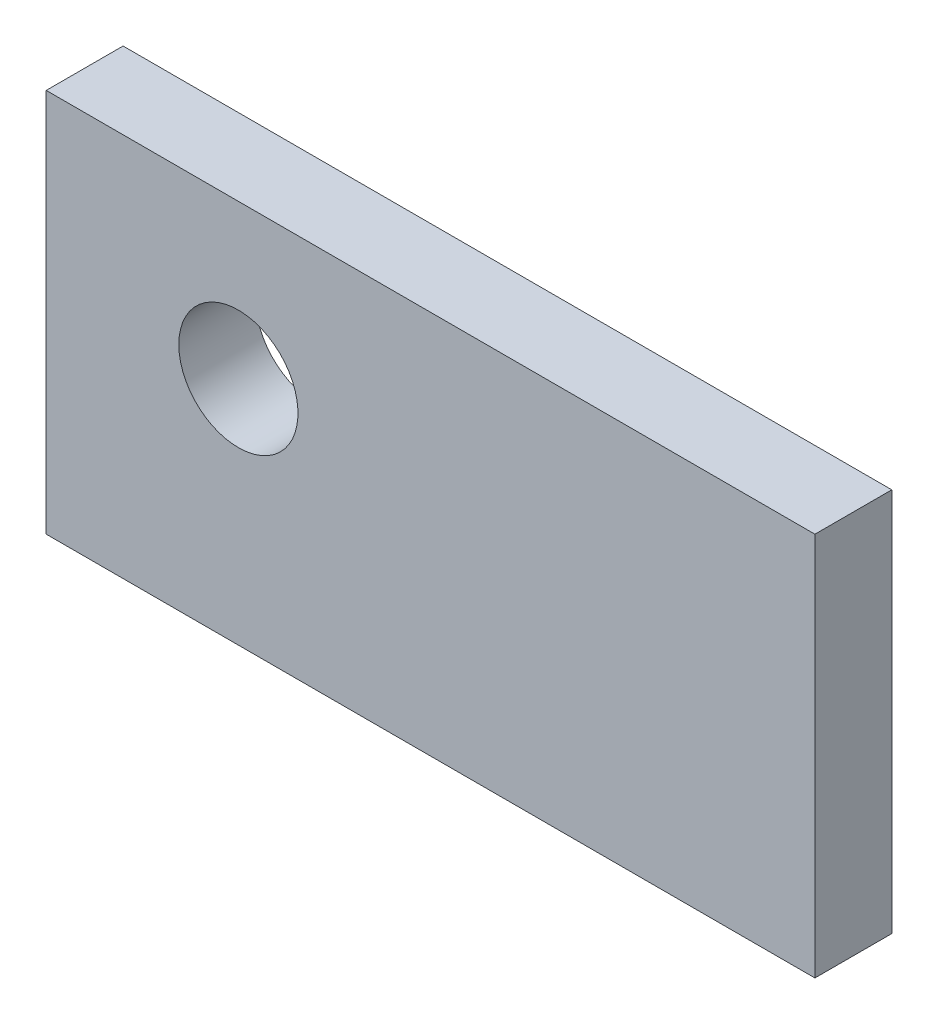
ISO-10303-21;
HEADER;
FILE_DESCRIPTION(('STEP AP214'),'2;1');
FILE_NAME('part.step','',(''),(''),'','','');
FILE_SCHEMA(('AUTOMOTIVE_DESIGN { 1 0 10303 214 1 1 1 1 }'));
ENDSEC;
DATA;
#1=APPLICATION_CONTEXT('core data for automotive mechanical design processes');
#2=APPLICATION_PROTOCOL_DEFINITION('international standard','automotive_design',2000,#1);
#3=PRODUCT_CONTEXT('',#1,'mechanical');
#4=PRODUCT('Part','Part','',(#3));
#5=PRODUCT_RELATED_PRODUCT_CATEGORY('part','',(#4));
#6=PRODUCT_DEFINITION_FORMATION('','',#4);
#7=PRODUCT_DEFINITION_CONTEXT('part definition',#1,'design');
#8=PRODUCT_DEFINITION('design','',#6,#7);
#9=PRODUCT_DEFINITION_SHAPE('','',#8);
#10=(LENGTH_UNIT() NAMED_UNIT(*) SI_UNIT(.MILLI.,.METRE.));
#11=(NAMED_UNIT(*) PLANE_ANGLE_UNIT() SI_UNIT($,.RADIAN.));
#12=(NAMED_UNIT(*) SI_UNIT($,.STERADIAN.) SOLID_ANGLE_UNIT());
#13=UNCERTAINTY_MEASURE_WITH_UNIT(LENGTH_MEASURE(1.E-05),#10,'distance_accuracy_value','');
#14=(GEOMETRIC_REPRESENTATION_CONTEXT(3) GLOBAL_UNCERTAINTY_ASSIGNED_CONTEXT((#13)) GLOBAL_UNIT_ASSIGNED_CONTEXT((#10,
#11,#12)) REPRESENTATION_CONTEXT('',''));
#15=CARTESIAN_POINT('',(0.,0.,0.));
#16=DIRECTION('',(0.,0.,1.));
#17=DIRECTION('',(1.,0.,0.));
#18=AXIS2_PLACEMENT_3D('',#15,#16,#17);
#19=CARTESIAN_POINT('',(40.,0.,0.));
#20=DIRECTION('',(0.,0.,-1.));
#21=DIRECTION('',(-1.,0.,0.));
#22=AXIS2_PLACEMENT_3D('',#19,#20,#21);
#23=PLANE('',#22);
#24=CARTESIAN_POINT('',(10.,12.,0.));
#25=DIRECTION('',(0.,0.,-1.));
#26=DIRECTION('',(-1.,0.,0.));
#27=AXIS2_PLACEMENT_3D('',#24,#25,#26);
#28=CIRCLE('',#27,3.1);
#29=CARTESIAN_POINT('',(6.9,12.,0.));
#30=VERTEX_POINT('',#29);
#31=EDGE_CURVE('E111',#30,#30,#28,.T.);
#32=ORIENTED_EDGE('',*,*,#31,.T.);
#33=EDGE_LOOP('',(#32));
#34=FACE_BOUND('',#33,.T.);
#35=DIRECTION('',(0.,-1.,0.));
#36=VECTOR('',#35,1.);
#37=CARTESIAN_POINT('',(0.,0.,0.));
#38=LINE('',#37,#36);
#39=CARTESIAN_POINT('',(0.,20.,0.));
#40=VERTEX_POINT('',#39);
#41=CARTESIAN_POINT('',(0.,0.,0.));
#42=VERTEX_POINT('',#41);
#43=EDGE_CURVE('E107',#40,#42,#38,.T.);
#44=ORIENTED_EDGE('',*,*,#43,.T.);
#45=DIRECTION('',(-1.,0.,0.));
#46=VECTOR('',#45,1.);
#47=CARTESIAN_POINT('',(40.,0.,0.));
#48=LINE('',#47,#46);
#49=CARTESIAN_POINT('',(40.,0.,0.));
#50=VERTEX_POINT('',#49);
#51=EDGE_CURVE('E11',#50,#42,#48,.T.);
#52=ORIENTED_EDGE('',*,*,#51,.F.);
#53=DIRECTION('',(0.,-1.,0.));
#54=VECTOR('',#53,1.);
#55=CARTESIAN_POINT('',(40.,0.,0.));
#56=LINE('',#55,#54);
#57=CARTESIAN_POINT('',(40.,20.,0.));
#58=VERTEX_POINT('',#57);
#59=EDGE_CURVE('E91',#58,#50,#56,.T.);
#60=ORIENTED_EDGE('',*,*,#59,.F.);
#61=DIRECTION('',(-1.,0.,0.));
#62=VECTOR('',#61,1.);
#63=CARTESIAN_POINT('',(40.,20.,0.));
#64=LINE('',#63,#62);
#65=EDGE_CURVE('E103',#58,#40,#64,.T.);
#66=ORIENTED_EDGE('',*,*,#65,.T.);
#67=EDGE_LOOP('',(#44,#52,#60,#66));
#68=FACE_BOUND('',#67,.T.);
#69=ADVANCED_FACE('F39',(#34,#68),#23,.F.);
#70=CARTESIAN_POINT('',(40.,0.,0.));
#71=DIRECTION('',(0.,1.,0.));
#72=DIRECTION('',(0.,0.,1.));
#73=AXIS2_PLACEMENT_3D('',#70,#71,#72);
#74=PLANE('',#73);
#75=DIRECTION('',(0.,0.,-1.));
#76=VECTOR('',#75,1.);
#77=CARTESIAN_POINT('',(0.,0.,0.));
#78=LINE('',#77,#76);
#79=CARTESIAN_POINT('',(0.,0.,-4.));
#80=VERTEX_POINT('',#79);
#81=EDGE_CURVE('E96',#42,#80,#78,.T.);
#82=ORIENTED_EDGE('',*,*,#81,.T.);
#83=DIRECTION('',(-1.,0.,0.));
#84=VECTOR('',#83,1.);
#85=CARTESIAN_POINT('',(40.,0.,-4.));
#86=LINE('',#85,#84);
#87=CARTESIAN_POINT('',(40.,0.,-4.));
#88=VERTEX_POINT('',#87);
#89=EDGE_CURVE('E48',#88,#80,#86,.T.);
#90=ORIENTED_EDGE('',*,*,#89,.F.);
#91=DIRECTION('',(0.,0.,-1.));
#92=VECTOR('',#91,1.);
#93=CARTESIAN_POINT('',(40.,0.,0.));
#94=LINE('',#93,#92);
#95=EDGE_CURVE('E86',#50,#88,#94,.T.);
#96=ORIENTED_EDGE('',*,*,#95,.F.);
#97=ORIENTED_EDGE('',*,*,#51,.T.);
#98=EDGE_LOOP('',(#82,#90,#96,#97));
#99=FACE_BOUND('',#98,.T.);
#100=ADVANCED_FACE('F95',(#99),#74,.F.);
#101=CARTESIAN_POINT('',(40.,0.,-4.));
#102=DIRECTION('',(0.,0.,1.));
#103=DIRECTION('',(1.,0.,0.));
#104=AXIS2_PLACEMENT_3D('',#101,#102,#103);
#105=PLANE('',#104);
#106=CARTESIAN_POINT('',(10.,12.,-4.));
#107=DIRECTION('',(0.,0.,-1.));
#108=DIRECTION('',(-1.,0.,0.));
#109=AXIS2_PLACEMENT_3D('',#106,#107,#108);
#110=CIRCLE('',#109,3.1);
#111=CARTESIAN_POINT('',(6.9,12.,-4.));
#112=VERTEX_POINT('',#111);
#113=EDGE_CURVE('E128',#112,#112,#110,.T.);
#114=ORIENTED_EDGE('',*,*,#113,.F.);
#115=EDGE_LOOP('',(#114));
#116=FACE_BOUND('',#115,.T.);
#117=DIRECTION('',(0.,1.,0.));
#118=VECTOR('',#117,1.);
#119=CARTESIAN_POINT('',(0.,0.,-4.));
#120=LINE('',#119,#118);
#121=CARTESIAN_POINT('',(0.,20.,-4.));
#122=VERTEX_POINT('',#121);
#123=EDGE_CURVE('E73',#80,#122,#120,.T.);
#124=ORIENTED_EDGE('',*,*,#123,.T.);
#125=DIRECTION('',(-1.,0.,0.));
#126=VECTOR('',#125,1.);
#127=CARTESIAN_POINT('',(40.,20.,-4.));
#128=LINE('',#127,#126);
#129=CARTESIAN_POINT('',(40.,20.,-4.));
#130=VERTEX_POINT('',#129);
#131=EDGE_CURVE('E98',#130,#122,#128,.T.);
#132=ORIENTED_EDGE('',*,*,#131,.F.);
#133=DIRECTION('',(0.,1.,0.));
#134=VECTOR('',#133,1.);
#135=CARTESIAN_POINT('',(40.,0.,-4.));
#136=LINE('',#135,#134);
#137=EDGE_CURVE('E89',#88,#130,#136,.T.);
#138=ORIENTED_EDGE('',*,*,#137,.F.);
#139=ORIENTED_EDGE('',*,*,#89,.T.);
#140=EDGE_LOOP('',(#124,#132,#138,#139));
#141=FACE_BOUND('',#140,.T.);
#142=ADVANCED_FACE('F99',(#116,#141),#105,.F.);
#143=CARTESIAN_POINT('',(40.,20.,0.));
#144=DIRECTION('',(0.,-1.,0.));
#145=DIRECTION('',(0.,0.,-1.));
#146=AXIS2_PLACEMENT_3D('',#143,#144,#145);
#147=PLANE('',#146);
#148=DIRECTION('',(0.,0.,1.));
#149=VECTOR('',#148,1.);
#150=CARTESIAN_POINT('',(0.,20.,0.));
#151=LINE('',#150,#149);
#152=EDGE_CURVE('E79',#122,#40,#151,.T.);
#153=ORIENTED_EDGE('',*,*,#152,.T.);
#154=ORIENTED_EDGE('',*,*,#65,.F.);
#155=DIRECTION('',(0.,0.,1.));
#156=VECTOR('',#155,1.);
#157=CARTESIAN_POINT('',(40.,20.,0.));
#158=LINE('',#157,#156);
#159=EDGE_CURVE('E56',#130,#58,#158,.T.);
#160=ORIENTED_EDGE('',*,*,#159,.F.);
#161=ORIENTED_EDGE('',*,*,#131,.T.);
#162=EDGE_LOOP('',(#153,#154,#160,#161));
#163=FACE_BOUND('',#162,.T.);
#164=ADVANCED_FACE('F121',(#163),#147,.F.);
#165=CARTESIAN_POINT('',(40.,0.,0.));
#166=DIRECTION('',(-1.,0.,0.));
#167=DIRECTION('',(0.,0.,1.));
#168=AXIS2_PLACEMENT_3D('',#165,#166,#167);
#169=PLANE('',#168);
#170=ORIENTED_EDGE('',*,*,#59,.T.);
#171=ORIENTED_EDGE('',*,*,#95,.T.);
#172=ORIENTED_EDGE('',*,*,#137,.T.);
#173=ORIENTED_EDGE('',*,*,#159,.T.);
#174=EDGE_LOOP('',(#170,#171,#172,#173));
#175=FACE_BOUND('',#174,.T.);
#176=ADVANCED_FACE('F87',(#175),#169,.F.);
#177=CARTESIAN_POINT('',(0.,0.,0.));
#178=DIRECTION('',(-1.,0.,0.));
#179=DIRECTION('',(0.,0.,1.));
#180=AXIS2_PLACEMENT_3D('',#177,#178,#179);
#181=PLANE('',#180);
#182=ORIENTED_EDGE('',*,*,#43,.F.);
#183=ORIENTED_EDGE('',*,*,#152,.F.);
#184=ORIENTED_EDGE('',*,*,#123,.F.);
#185=ORIENTED_EDGE('',*,*,#81,.F.);
#186=EDGE_LOOP('',(#182,#183,#184,#185));
#187=FACE_BOUND('',#186,.T.);
#188=ADVANCED_FACE('F124',(#187),#181,.T.);
#189=CARTESIAN_POINT('',(10.,12.,0.));
#190=DIRECTION('',(0.,0.,-1.));
#191=DIRECTION('',(-1.,0.,0.));
#192=AXIS2_PLACEMENT_3D('',#189,#190,#191);
#193=CYLINDRICAL_SURFACE('',#192,3.1);
#194=ORIENTED_EDGE('',*,*,#31,.F.);
#195=EDGE_LOOP('',(#194));
#196=FACE_BOUND('',#195,.T.);
#197=ORIENTED_EDGE('',*,*,#113,.T.);
#198=EDGE_LOOP('',(#197));
#199=FACE_BOUND('',#198,.T.);
#200=ADVANCED_FACE('F137',(#196,#199),#193,.F.);
#201=CLOSED_SHELL('',(#69,#100,#142,#164,#176,#188,#200));
#202=MANIFOLD_SOLID_BREP('B2',#201);
#203=ADVANCED_BREP_SHAPE_REPRESENTATION('',(#18,#202),#14);
#204=SHAPE_DEFINITION_REPRESENTATION(#9,#203);
ENDSEC;
END-ISO-10303-21;
